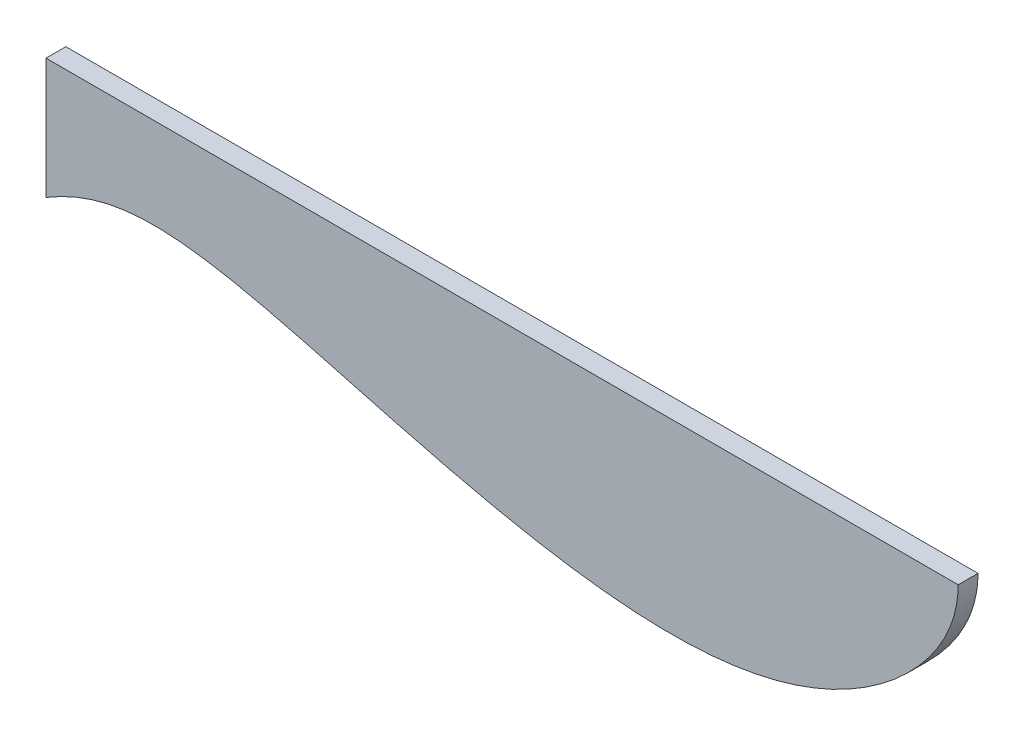
ISO-10303-21;
HEADER;
FILE_DESCRIPTION(('STEP AP214'),'2;1');
FILE_NAME('part.step','',(''),(''),'','','');
FILE_SCHEMA(('AUTOMOTIVE_DESIGN { 1 0 10303 214 1 1 1 1 }'));
ENDSEC;
DATA;
#1=APPLICATION_CONTEXT('core data for automotive mechanical design processes');
#2=APPLICATION_PROTOCOL_DEFINITION('international standard','automotive_design',2000,#1);
#3=PRODUCT_CONTEXT('',#1,'mechanical');
#4=PRODUCT('Part','Part','',(#3));
#5=PRODUCT_RELATED_PRODUCT_CATEGORY('part','',(#4));
#6=PRODUCT_DEFINITION_FORMATION('','',#4);
#7=PRODUCT_DEFINITION_CONTEXT('part definition',#1,'design');
#8=PRODUCT_DEFINITION('design','',#6,#7);
#9=PRODUCT_DEFINITION_SHAPE('','',#8);
#10=(LENGTH_UNIT() NAMED_UNIT(*) SI_UNIT(.MILLI.,.METRE.));
#11=(NAMED_UNIT(*) PLANE_ANGLE_UNIT() SI_UNIT($,.RADIAN.));
#12=(NAMED_UNIT(*) SI_UNIT($,.STERADIAN.) SOLID_ANGLE_UNIT());
#13=UNCERTAINTY_MEASURE_WITH_UNIT(LENGTH_MEASURE(1.E-05),#10,'distance_accuracy_value','');
#14=(GEOMETRIC_REPRESENTATION_CONTEXT(3) GLOBAL_UNCERTAINTY_ASSIGNED_CONTEXT((#13)) GLOBAL_UNIT_ASSIGNED_CONTEXT((#10,
#11,#12)) REPRESENTATION_CONTEXT('',''));
#15=CARTESIAN_POINT('',(0.,0.,0.));
#16=DIRECTION('',(0.,0.,1.));
#17=DIRECTION('',(1.,0.,0.));
#18=AXIS2_PLACEMENT_3D('',#15,#16,#17);
#19=CARTESIAN_POINT('',(-91.6170900084775,34.6113518197574,4.49));
#20=DIRECTION('',(1.,0.,0.));
#21=DIRECTION('',(0.,0.,-1.));
#22=AXIS2_PLACEMENT_3D('',#19,#20,#21);
#23=PLANE('',#22);
#24=DIRECTION('',(0.,-1.,0.));
#25=VECTOR('',#24,1.);
#26=CARTESIAN_POINT('',(-91.6170900084775,34.6113518197574,0.));
#27=LINE('',#26,#25);
#28=CARTESIAN_POINT('',(-91.6170900084775,34.6113518197574,0.));
#29=VERTEX_POINT('',#28);
#30=CARTESIAN_POINT('',(-91.6170900084775,7.29644714038129,0.));
#31=VERTEX_POINT('',#30);
#32=EDGE_CURVE('E82',#29,#31,#27,.T.);
#33=ORIENTED_EDGE('',*,*,#32,.T.);
#34=DIRECTION('',(0.,0.,-1.));
#35=VECTOR('',#34,1.);
#36=CARTESIAN_POINT('',(-91.6170900084775,7.29644714038129,4.49));
#37=LINE('',#36,#35);
#38=CARTESIAN_POINT('',(-91.6170900084775,7.29644714038129,4.49));
#39=VERTEX_POINT('',#38);
#40=EDGE_CURVE('E11',#39,#31,#37,.T.);
#41=ORIENTED_EDGE('',*,*,#40,.F.);
#42=DIRECTION('',(0.,-1.,0.));
#43=VECTOR('',#42,1.);
#44=CARTESIAN_POINT('',(-91.6170900084775,34.6113518197574,4.49));
#45=LINE('',#44,#43);
#46=CARTESIAN_POINT('',(-91.6170900084775,34.6113518197574,4.49));
#47=VERTEX_POINT('',#46);
#48=EDGE_CURVE('E75',#47,#39,#45,.T.);
#49=ORIENTED_EDGE('',*,*,#48,.F.);
#50=DIRECTION('',(0.,0.,-1.));
#51=VECTOR('',#50,1.);
#52=CARTESIAN_POINT('',(-91.6170900084775,34.6113518197574,4.49));
#53=LINE('',#52,#51);
#54=EDGE_CURVE('E83',#47,#29,#53,.T.);
#55=ORIENTED_EDGE('',*,*,#54,.T.);
#56=EDGE_LOOP('',(#33,#41,#49,#55));
#57=FACE_BOUND('',#56,.T.);
#58=ADVANCED_FACE('F35',(#57),#23,.F.);
#59=CARTESIAN_POINT('',(-91.6170900084775,7.29644714038129,4.49));
#60=CARTESIAN_POINT('',(-68.7923066462591,20.9538994800693,4.49));
#61=CARTESIAN_POINT('',(-53.4510588126369,15.5283362218371,4.49));
#62=CARTESIAN_POINT('',(-25.0136238039714,7.29644714038129,4.49));
#63=CARTESIAN_POINT('',(0.804573769685457,-3.5546793760832,4.49));
#64=CARTESIAN_POINT('',(30.3645391076404,-12.1607452339688,4.49));
#65=CARTESIAN_POINT('',(56.9310902341569,-12.1607452339688,4.49));
#66=CARTESIAN_POINT('',(70.40145418563,-12.1607452339688,4.49));
#67=CARTESIAN_POINT('',(87.987762677831,-5.42556325823224,4.49));
#68=CARTESIAN_POINT('',(105.948247946462,7.29644714038129,4.49));
#69=CARTESIAN_POINT('',(114.928490580777,20.9538994800693,4.49));
#70=CARTESIAN_POINT('',(114.928490580777,34.6113518197574,4.49));
#71=B_SPLINE_CURVE_WITH_KNOTS('',11,(#59,#60,#61,#62,#63,#64,#65,#66,#67,#68,#69,#70),
.UNSPECIFIED.,.F.,.F.,(12,12),(0.,1.),.UNSPECIFIED.);
#72=DIRECTION('',(0.,0.,-1.));
#73=VECTOR('',#72,1.);
#74=SURFACE_OF_LINEAR_EXTRUSION('',#71,#73);
#75=CARTESIAN_POINT('',(-91.6170900084775,7.29644714038129,0.));
#76=CARTESIAN_POINT('',(-68.7923066462591,20.9538994800693,0.));
#77=CARTESIAN_POINT('',(-53.4510588126369,15.5283362218371,0.));
#78=CARTESIAN_POINT('',(-25.0136238039714,7.29644714038129,0.));
#79=CARTESIAN_POINT('',(0.804573769685457,-3.5546793760832,0.));
#80=CARTESIAN_POINT('',(30.3645391076404,-12.1607452339688,0.));
#81=CARTESIAN_POINT('',(56.9310902341569,-12.1607452339688,0.));
#82=CARTESIAN_POINT('',(70.40145418563,-12.1607452339688,0.));
#83=CARTESIAN_POINT('',(87.987762677831,-5.42556325823224,0.));
#84=CARTESIAN_POINT('',(105.948247946462,7.29644714038129,0.));
#85=CARTESIAN_POINT('',(114.928490580777,20.9538994800693,0.));
#86=CARTESIAN_POINT('',(114.928490580777,34.6113518197574,0.));
#87=B_SPLINE_CURVE_WITH_KNOTS('',11,(#75,#76,#77,#78,#79,#80,#81,#82,#83,#84,#85,#86),
.UNSPECIFIED.,.F.,.F.,(12,12),(0.,1.),.UNSPECIFIED.);
#88=CARTESIAN_POINT('',(114.928490580777,34.6113518197574,0.));
#89=VERTEX_POINT('',#88);
#90=EDGE_CURVE('E63',#31,#89,#87,.T.);
#91=ORIENTED_EDGE('',*,*,#90,.T.);
#92=DIRECTION('',(0.,0.,-1.));
#93=VECTOR('',#92,1.);
#94=CARTESIAN_POINT('',(114.928490580777,34.6113518197574,4.49));
#95=LINE('',#94,#93);
#96=CARTESIAN_POINT('',(114.928490580777,34.6113518197574,4.49));
#97=VERTEX_POINT('',#96);
#98=EDGE_CURVE('E43',#97,#89,#95,.T.);
#99=ORIENTED_EDGE('',*,*,#98,.F.);
#100=EDGE_CURVE('E71',#39,#97,#71,.T.);
#101=ORIENTED_EDGE('',*,*,#100,.F.);
#102=ORIENTED_EDGE('',*,*,#40,.T.);
#103=EDGE_LOOP('',(#91,#99,#101,#102));
#104=FACE_BOUND('',#103,.T.);
#105=ADVANCED_FACE('F72',(#104),#74,.F.);
#106=CARTESIAN_POINT('',(-91.6170900084775,34.6113518197574,4.49));
#107=DIRECTION('',(0.,-1.,0.));
#108=DIRECTION('',(0.,0.,-1.));
#109=AXIS2_PLACEMENT_3D('',#106,#107,#108);
#110=PLANE('',#109);
#111=DIRECTION('',(-1.,0.,0.));
#112=VECTOR('',#111,1.);
#113=CARTESIAN_POINT('',(-91.6170900084775,34.6113518197574,0.));
#114=LINE('',#113,#112);
#115=EDGE_CURVE('E68',#89,#29,#114,.T.);
#116=ORIENTED_EDGE('',*,*,#115,.T.);
#117=ORIENTED_EDGE('',*,*,#54,.F.);
#118=DIRECTION('',(-1.,0.,0.));
#119=VECTOR('',#118,1.);
#120=CARTESIAN_POINT('',(-91.6170900084775,34.6113518197574,4.49));
#121=LINE('',#120,#119);
#122=EDGE_CURVE('E51',#97,#47,#121,.T.);
#123=ORIENTED_EDGE('',*,*,#122,.F.);
#124=ORIENTED_EDGE('',*,*,#98,.T.);
#125=EDGE_LOOP('',(#116,#117,#123,#124));
#126=FACE_BOUND('',#125,.T.);
#127=ADVANCED_FACE('F95',(#126),#110,.F.);
#128=CARTESIAN_POINT('',(37.9089149031072,-7.00960263891898,4.49));
#129=DIRECTION('',(0.,0.,1.));
#130=DIRECTION('',(1.,0.,0.));
#131=AXIS2_PLACEMENT_3D('',#128,#129,#130);
#132=PLANE('',#131);
#133=ORIENTED_EDGE('',*,*,#48,.T.);
#134=ORIENTED_EDGE('',*,*,#100,.T.);
#135=ORIENTED_EDGE('',*,*,#122,.T.);
#136=EDGE_LOOP('',(#133,#134,#135));
#137=FACE_BOUND('',#136,.T.);
#138=ADVANCED_FACE('F78',(#137),#132,.T.);
#139=CARTESIAN_POINT('',(37.9089149031072,-7.00960263891898,0.));
#140=DIRECTION('',(0.,0.,1.));
#141=DIRECTION('',(1.,0.,0.));
#142=AXIS2_PLACEMENT_3D('',#139,#140,#141);
#143=PLANE('',#142);
#144=ORIENTED_EDGE('',*,*,#32,.F.);
#145=ORIENTED_EDGE('',*,*,#115,.F.);
#146=ORIENTED_EDGE('',*,*,#90,.F.);
#147=EDGE_LOOP('',(#144,#145,#146));
#148=FACE_BOUND('',#147,.T.);
#149=ADVANCED_FACE('F96',(#148),#143,.F.);
#150=CLOSED_SHELL('',(#58,#105,#127,#138,#149));
#151=MANIFOLD_SOLID_BREP('B2',#150);
#152=ADVANCED_BREP_SHAPE_REPRESENTATION('',(#18,#151),#14);
#153=SHAPE_DEFINITION_REPRESENTATION(#9,#152);
ENDSEC;
END-ISO-10303-21;
